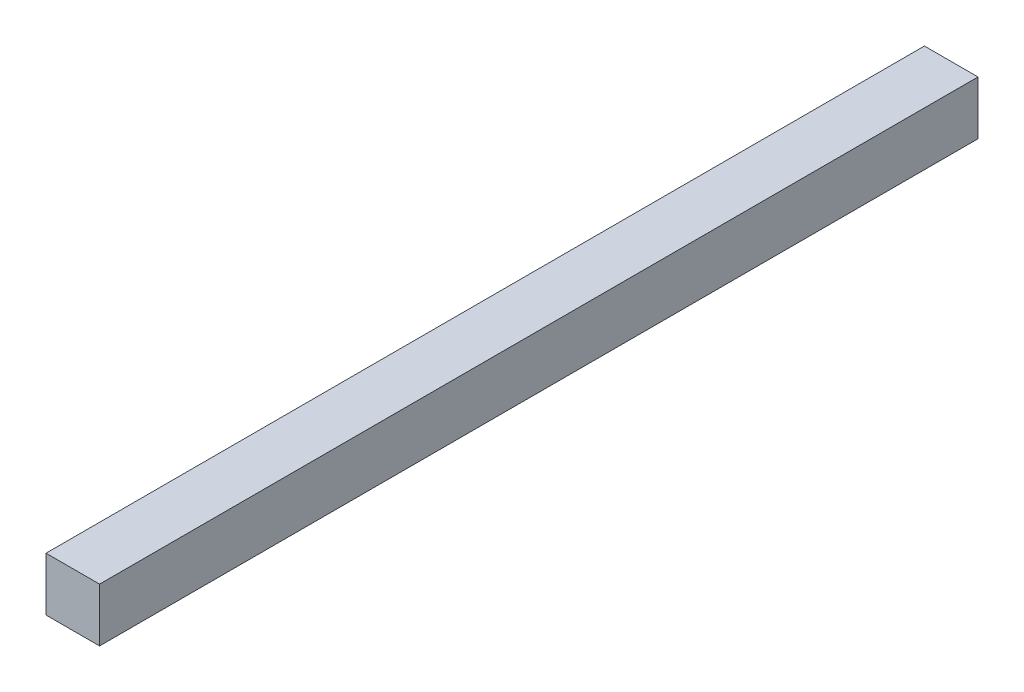
ISO-10303-21;
HEADER;
FILE_DESCRIPTION(('STEP AP214'),'2;1');
FILE_NAME('part.step','',(''),(''),'','','');
FILE_SCHEMA(('AUTOMOTIVE_DESIGN { 1 0 10303 214 1 1 1 1 }'));
ENDSEC;
DATA;
#1=APPLICATION_CONTEXT('core data for automotive mechanical design processes');
#2=APPLICATION_PROTOCOL_DEFINITION('international standard','automotive_design',2000,#1);
#3=PRODUCT_CONTEXT('',#1,'mechanical');
#4=PRODUCT('Part','Part','',(#3));
#5=PRODUCT_RELATED_PRODUCT_CATEGORY('part','',(#4));
#6=PRODUCT_DEFINITION_FORMATION('','',#4);
#7=PRODUCT_DEFINITION_CONTEXT('part definition',#1,'design');
#8=PRODUCT_DEFINITION('design','',#6,#7);
#9=PRODUCT_DEFINITION_SHAPE('','',#8);
#10=(LENGTH_UNIT() NAMED_UNIT(*) SI_UNIT(.MILLI.,.METRE.));
#11=(NAMED_UNIT(*) PLANE_ANGLE_UNIT() SI_UNIT($,.RADIAN.));
#12=(NAMED_UNIT(*) SI_UNIT($,.STERADIAN.) SOLID_ANGLE_UNIT());
#13=UNCERTAINTY_MEASURE_WITH_UNIT(LENGTH_MEASURE(1.E-05),#10,'distance_accuracy_value','');
#14=(GEOMETRIC_REPRESENTATION_CONTEXT(3) GLOBAL_UNCERTAINTY_ASSIGNED_CONTEXT((#13)) GLOBAL_UNIT_ASSIGNED_CONTEXT((#10,
#11,#12)) REPRESENTATION_CONTEXT('',''));
#15=CARTESIAN_POINT('',(0.,0.,0.));
#16=DIRECTION('',(0.,0.,1.));
#17=DIRECTION('',(1.,0.,0.));
#18=AXIS2_PLACEMENT_3D('',#15,#16,#17);
#19=CARTESIAN_POINT('',(0.,0.,0.));
#20=DIRECTION('',(1.,0.,0.));
#21=DIRECTION('',(0.,0.,-1.));
#22=AXIS2_PLACEMENT_3D('',#19,#20,#21);
#23=PLANE('',#22);
#24=DIRECTION('',(0.,1.,0.));
#25=VECTOR('',#24,1.);
#26=CARTESIAN_POINT('',(0.,0.,0.41656));
#27=LINE('',#26,#25);
#28=CARTESIAN_POINT('',(0.,-0.0254,0.41656));
#29=VERTEX_POINT('',#28);
#30=CARTESIAN_POINT('',(0.,0.,0.41656));
#31=VERTEX_POINT('',#30);
#32=EDGE_CURVE('E53',#29,#31,#27,.T.);
#33=ORIENTED_EDGE('',*,*,#32,.T.);
#34=DIRECTION('',(0.,0.,-1.));
#35=VECTOR('',#34,1.);
#36=CARTESIAN_POINT('',(0.,0.,0.));
#37=LINE('',#36,#35);
#38=CARTESIAN_POINT('',(0.,0.,0.));
#39=VERTEX_POINT('',#38);
#40=EDGE_CURVE('E61',#31,#39,#37,.T.);
#41=ORIENTED_EDGE('',*,*,#40,.T.);
#42=DIRECTION('',(0.,1.,0.));
#43=VECTOR('',#42,1.);
#44=CARTESIAN_POINT('',(0.,0.,0.));
#45=LINE('',#44,#43);
#46=CARTESIAN_POINT('',(0.,-0.0254,0.));
#47=VERTEX_POINT('',#46);
#48=EDGE_CURVE('E20',#47,#39,#45,.T.);
#49=ORIENTED_EDGE('',*,*,#48,.F.);
#50=DIRECTION('',(0.,0.,1.));
#51=VECTOR('',#50,1.);
#52=CARTESIAN_POINT('',(0.,-0.0254,0.));
#53=LINE('',#52,#51);
#54=EDGE_CURVE('E59',#47,#29,#53,.T.);
#55=ORIENTED_EDGE('',*,*,#54,.T.);
#56=EDGE_LOOP('',(#33,#41,#49,#55));
#57=FACE_BOUND('',#56,.T.);
#58=ADVANCED_FACE('F17',(#57),#23,.F.);
#59=CARTESIAN_POINT('',(0.,0.,0.));
#60=DIRECTION('',(0.,0.,-1.));
#61=DIRECTION('',(-1.,0.,0.));
#62=AXIS2_PLACEMENT_3D('',#59,#60,#61);
#63=PLANE('',#62);
#64=DIRECTION('',(1.,0.,0.));
#65=VECTOR('',#64,1.);
#66=CARTESIAN_POINT('',(0.0254,0.,0.));
#67=LINE('',#66,#65);
#68=CARTESIAN_POINT('',(0.0254,0.,0.));
#69=VERTEX_POINT('',#68);
#70=EDGE_CURVE('E79',#39,#69,#67,.T.);
#71=ORIENTED_EDGE('',*,*,#70,.T.);
#72=DIRECTION('',(0.,1.,0.));
#73=VECTOR('',#72,1.);
#74=CARTESIAN_POINT('',(0.0254,-0.0254,0.));
#75=LINE('',#74,#73);
#76=CARTESIAN_POINT('',(0.0254,-0.0254,0.));
#77=VERTEX_POINT('',#76);
#78=EDGE_CURVE('E75',#69,#77,#75,.F.);
#79=ORIENTED_EDGE('',*,*,#78,.T.);
#80=DIRECTION('',(1.,0.,0.));
#81=VECTOR('',#80,1.);
#82=CARTESIAN_POINT('',(0.,-0.0254,0.));
#83=LINE('',#82,#81);
#84=EDGE_CURVE('E66',#77,#47,#83,.F.);
#85=ORIENTED_EDGE('',*,*,#84,.T.);
#86=ORIENTED_EDGE('',*,*,#48,.T.);
#87=EDGE_LOOP('',(#71,#79,#85,#86));
#88=FACE_BOUND('',#87,.T.);
#89=ADVANCED_FACE('F74',(#88),#63,.T.);
#90=CARTESIAN_POINT('',(0.,-0.0254,0.));
#91=DIRECTION('',(0.,1.,0.));
#92=DIRECTION('',(0.,0.,1.));
#93=AXIS2_PLACEMENT_3D('',#90,#91,#92);
#94=PLANE('',#93);
#95=DIRECTION('',(-1.,0.,0.));
#96=VECTOR('',#95,1.);
#97=CARTESIAN_POINT('',(0.,-0.0254,0.41656));
#98=LINE('',#97,#96);
#99=CARTESIAN_POINT('',(0.0254,-0.0254,0.41656));
#100=VERTEX_POINT('',#99);
#101=EDGE_CURVE('E71',#100,#29,#98,.T.);
#102=ORIENTED_EDGE('',*,*,#101,.T.);
#103=ORIENTED_EDGE('',*,*,#54,.F.);
#104=ORIENTED_EDGE('',*,*,#84,.F.);
#105=DIRECTION('',(0.,0.,1.));
#106=VECTOR('',#105,1.);
#107=CARTESIAN_POINT('',(0.0254,-0.0254,0.));
#108=LINE('',#107,#106);
#109=EDGE_CURVE('E84',#77,#100,#108,.T.);
#110=ORIENTED_EDGE('',*,*,#109,.T.);
#111=EDGE_LOOP('',(#102,#103,#104,#110));
#112=FACE_BOUND('',#111,.T.);
#113=ADVANCED_FACE('F68',(#112),#94,.F.);
#114=CARTESIAN_POINT('',(0.,0.,0.41656));
#115=DIRECTION('',(0.,0.,-1.));
#116=DIRECTION('',(-1.,0.,0.));
#117=AXIS2_PLACEMENT_3D('',#114,#115,#116);
#118=PLANE('',#117);
#119=DIRECTION('',(0.,1.,0.));
#120=VECTOR('',#119,1.);
#121=CARTESIAN_POINT('',(0.0254,-0.0254,0.41656));
#122=LINE('',#121,#120);
#123=CARTESIAN_POINT('',(0.0254,0.,0.41656));
#124=VERTEX_POINT('',#123);
#125=EDGE_CURVE('E26',#100,#124,#122,.T.);
#126=ORIENTED_EDGE('',*,*,#125,.T.);
#127=DIRECTION('',(1.,0.,0.));
#128=VECTOR('',#127,1.);
#129=CARTESIAN_POINT('',(0.0254,0.,0.41656));
#130=LINE('',#129,#128);
#131=EDGE_CURVE('E34',#124,#31,#130,.F.);
#132=ORIENTED_EDGE('',*,*,#131,.T.);
#133=ORIENTED_EDGE('',*,*,#32,.F.);
#134=ORIENTED_EDGE('',*,*,#101,.F.);
#135=EDGE_LOOP('',(#126,#132,#133,#134));
#136=FACE_BOUND('',#135,.T.);
#137=ADVANCED_FACE('F88',(#136),#118,.F.);
#138=CARTESIAN_POINT('',(0.0254,0.,0.));
#139=DIRECTION('',(0.,-1.,0.));
#140=DIRECTION('',(0.,0.,-1.));
#141=AXIS2_PLACEMENT_3D('',#138,#139,#140);
#142=PLANE('',#141);
#143=ORIENTED_EDGE('',*,*,#131,.F.);
#144=DIRECTION('',(0.,0.,1.));
#145=VECTOR('',#144,1.);
#146=CARTESIAN_POINT('',(0.0254,0.,0.));
#147=LINE('',#146,#145);
#148=EDGE_CURVE('E11',#124,#69,#147,.F.);
#149=ORIENTED_EDGE('',*,*,#148,.T.);
#150=ORIENTED_EDGE('',*,*,#70,.F.);
#151=ORIENTED_EDGE('',*,*,#40,.F.);
#152=EDGE_LOOP('',(#143,#149,#150,#151));
#153=FACE_BOUND('',#152,.T.);
#154=ADVANCED_FACE('F91',(#153),#142,.F.);
#155=CARTESIAN_POINT('',(0.0254,-0.0254,0.));
#156=DIRECTION('',(-1.,0.,0.));
#157=DIRECTION('',(0.,0.,1.));
#158=AXIS2_PLACEMENT_3D('',#155,#156,#157);
#159=PLANE('',#158);
#160=ORIENTED_EDGE('',*,*,#125,.F.);
#161=ORIENTED_EDGE('',*,*,#109,.F.);
#162=ORIENTED_EDGE('',*,*,#78,.F.);
#163=ORIENTED_EDGE('',*,*,#148,.F.);
#164=EDGE_LOOP('',(#160,#161,#162,#163));
#165=FACE_BOUND('',#164,.T.);
#166=ADVANCED_FACE('F90',(#165),#159,.F.);
#167=CLOSED_SHELL('',(#58,#89,#113,#137,#154,#166));
#168=MANIFOLD_SOLID_BREP('B1',#167);
#169=ADVANCED_BREP_SHAPE_REPRESENTATION('',(#18,#168),#14);
#170=SHAPE_DEFINITION_REPRESENTATION(#9,#169);
ENDSEC;
END-ISO-10303-21;
